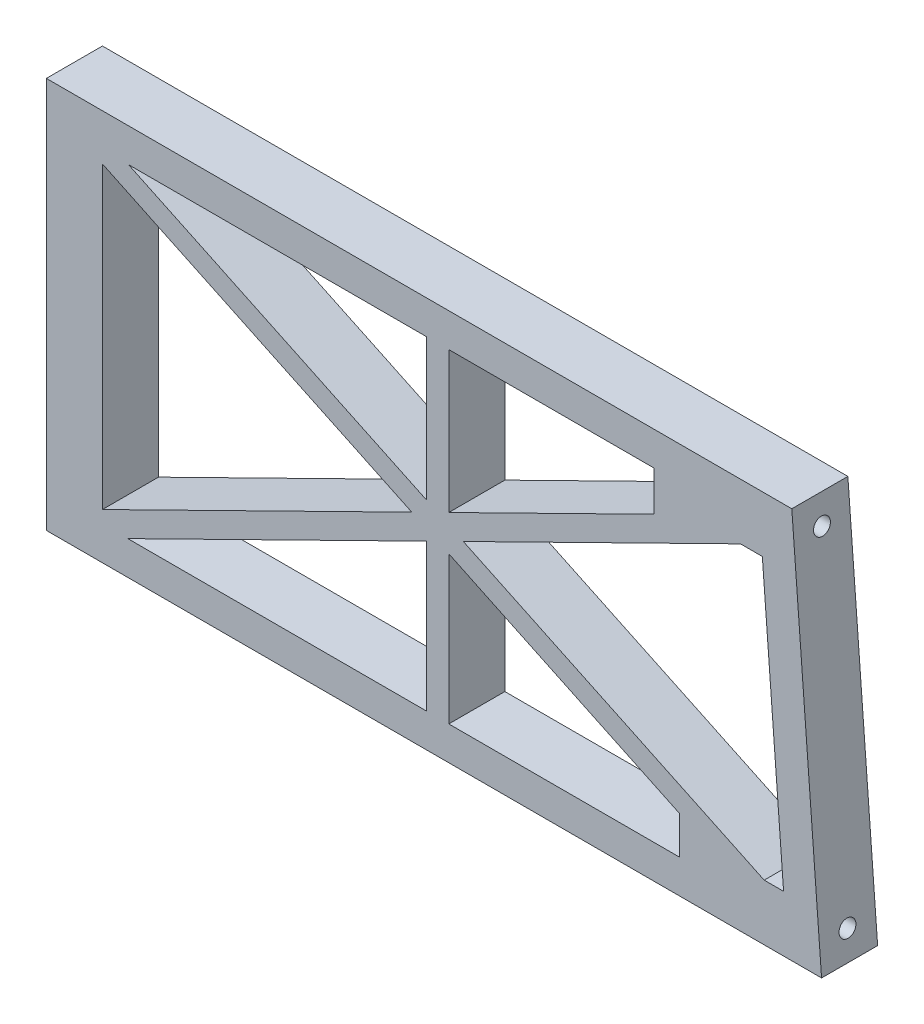
ISO-10303-21;
HEADER;
FILE_DESCRIPTION(('STEP AP214'),'2;1');
FILE_NAME('part.step','',(''),(''),'','','');
FILE_SCHEMA(('AUTOMOTIVE_DESIGN { 1 0 10303 214 1 1 1 1 }'));
ENDSEC;
DATA;
#1=APPLICATION_CONTEXT('core data for automotive mechanical design processes');
#2=APPLICATION_PROTOCOL_DEFINITION('international standard','automotive_design',2000,#1);
#3=PRODUCT_CONTEXT('',#1,'mechanical');
#4=PRODUCT('Part','Part','',(#3));
#5=PRODUCT_RELATED_PRODUCT_CATEGORY('part','',(#4));
#6=PRODUCT_DEFINITION_FORMATION('','',#4);
#7=PRODUCT_DEFINITION_CONTEXT('part definition',#1,'design');
#8=PRODUCT_DEFINITION('design','',#6,#7);
#9=PRODUCT_DEFINITION_SHAPE('','',#8);
#10=(LENGTH_UNIT() NAMED_UNIT(*) SI_UNIT(.MILLI.,.METRE.));
#11=(NAMED_UNIT(*) PLANE_ANGLE_UNIT() SI_UNIT($,.RADIAN.));
#12=(NAMED_UNIT(*) SI_UNIT($,.STERADIAN.) SOLID_ANGLE_UNIT());
#13=UNCERTAINTY_MEASURE_WITH_UNIT(LENGTH_MEASURE(1.E-05),#10,'distance_accuracy_value','');
#14=(GEOMETRIC_REPRESENTATION_CONTEXT(3) GLOBAL_UNCERTAINTY_ASSIGNED_CONTEXT((#13)) GLOBAL_UNIT_ASSIGNED_CONTEXT((#10,
#11,#12)) REPRESENTATION_CONTEXT('',''));
#15=CARTESIAN_POINT('',(0.,0.,0.));
#16=DIRECTION('',(0.,0.,1.));
#17=DIRECTION('',(1.,0.,0.));
#18=AXIS2_PLACEMENT_3D('',#15,#16,#17);
#19=CARTESIAN_POINT('',(0.,0.,0.));
#20=DIRECTION('',(1.,0.,0.));
#21=DIRECTION('',(0.,0.,-1.));
#22=AXIS2_PLACEMENT_3D('',#19,#20,#21);
#23=PLANE('',#22);
#24=DIRECTION('',(0.,-1.,0.));
#25=VECTOR('',#24,1.);
#26=CARTESIAN_POINT('',(0.,0.,-5.));
#27=LINE('',#26,#25);
#28=CARTESIAN_POINT('',(0.,34.9136152111375,-5.));
#29=VERTEX_POINT('',#28);
#30=CARTESIAN_POINT('',(0.,-34.9136152111375,-5.));
#31=VERTEX_POINT('',#30);
#32=EDGE_CURVE('E11',#29,#31,#27,.T.);
#33=ORIENTED_EDGE('',*,*,#32,.T.);
#34=DIRECTION('',(0.,0.,1.));
#35=VECTOR('',#34,1.);
#36=CARTESIAN_POINT('',(0.,-34.9136152111375,-5.));
#37=LINE('',#36,#35);
#38=CARTESIAN_POINT('',(0.,-34.9136152111375,5.));
#39=VERTEX_POINT('',#38);
#40=EDGE_CURVE('E44',#31,#39,#37,.T.);
#41=ORIENTED_EDGE('',*,*,#40,.T.);
#42=DIRECTION('',(0.,-1.,0.));
#43=VECTOR('',#42,1.);
#44=CARTESIAN_POINT('',(0.,0.,5.));
#45=LINE('',#44,#43);
#46=CARTESIAN_POINT('',(0.,34.9136152111375,5.));
#47=VERTEX_POINT('',#46);
#48=EDGE_CURVE('E379',#47,#39,#45,.T.);
#49=ORIENTED_EDGE('',*,*,#48,.F.);
#50=DIRECTION('',(0.,0.,-1.));
#51=VECTOR('',#50,1.);
#52=CARTESIAN_POINT('',(0.,34.9136152111375,-5.));
#53=LINE('',#52,#51);
#54=EDGE_CURVE('E50',#47,#29,#53,.T.);
#55=ORIENTED_EDGE('',*,*,#54,.T.);
#56=EDGE_LOOP('',(#33,#41,#49,#55));
#57=FACE_BOUND('',#56,.T.);
#58=ADVANCED_FACE('F37',(#57),#23,.F.);
#59=CARTESIAN_POINT('',(113.34,31.4136152111375,0.));
#60=DIRECTION('',(1.,0.,0.));
#61=DIRECTION('',(0.,0.,1.));
#62=AXIS2_PLACEMENT_3D('',#59,#60,#61);
#63=PLANE('',#62);
#64=CARTESIAN_POINT('',(113.34,29.9136152111375,0.));
#65=DIRECTION('',(-1.,0.,0.));
#66=DIRECTION('',(0.,0.,1.));
#67=AXIS2_PLACEMENT_3D('',#64,#65,#66);
#68=CIRCLE('',#67,1.5);
#69=CARTESIAN_POINT('',(113.34,29.9136152111375,1.5));
#70=VERTEX_POINT('',#69);
#71=EDGE_CURVE('E365',#70,#70,#68,.T.);
#72=ORIENTED_EDGE('',*,*,#71,.F.);
#73=EDGE_LOOP('',(#72));
#74=FACE_BOUND('',#73,.T.);
#75=ADVANCED_FACE('F493',(#74),#63,.T.);
#76=CARTESIAN_POINT('',(117.89,-28.4136152111376,0.));
#77=DIRECTION('',(1.,0.,0.));
#78=DIRECTION('',(0.,0.,1.));
#79=AXIS2_PLACEMENT_3D('',#76,#77,#78);
#80=PLANE('',#79);
#81=CARTESIAN_POINT('',(117.89,-29.9136152111376,0.));
#82=DIRECTION('',(-1.,0.,0.));
#83=DIRECTION('',(0.,0.,1.));
#84=AXIS2_PLACEMENT_3D('',#81,#82,#83);
#85=CIRCLE('',#84,1.5);
#86=CARTESIAN_POINT('',(117.89,-29.9136152111376,1.5));
#87=VERTEX_POINT('',#86);
#88=EDGE_CURVE('E369',#87,#87,#85,.T.);
#89=ORIENTED_EDGE('',*,*,#88,.F.);
#90=EDGE_LOOP('',(#89));
#91=FACE_BOUND('',#90,.T.);
#92=ADVANCED_FACE('F490',(#91),#80,.T.);
#93=CARTESIAN_POINT('',(152.822662449041,29.9136152111375,0.));
#94=DIRECTION('',(1.,0.,0.));
#95=DIRECTION('',(0.,0.,1.));
#96=AXIS2_PLACEMENT_3D('',#93,#94,#95);
#97=CYLINDRICAL_SURFACE('',#96,1.5);
#98=CARTESIAN_POINT('',(133.34,29.9136152111375,0.));
#99=DIRECTION('',(-0.997120507037919,-0.075833333333333,0.));
#100=DIRECTION('',(0.075833333333333,-0.997120507037919,0.));
#101=AXIS2_PLACEMENT_3D('',#98,#99,#100);
#102=ELLIPSE('',#101,1.504331712579,1.5);
#103=CARTESIAN_POINT('',(133.454078488204,28.4136152111375,0.));
#104=VERTEX_POINT('',#103);
#105=EDGE_CURVE('E224',#104,#104,#102,.F.);
#106=ORIENTED_EDGE('',*,*,#105,.T.);
#107=EDGE_LOOP('',(#106));
#108=FACE_BOUND('',#107,.T.);
#109=ORIENTED_EDGE('',*,*,#71,.T.);
#110=EDGE_LOOP('',(#109));
#111=FACE_BOUND('',#110,.T.);
#112=ADVANCED_FACE('F492',(#108,#111),#97,.F.);
#113=CARTESIAN_POINT('',(173.755810417553,-29.9136152111376,0.));
#114=DIRECTION('',(1.,0.,0.));
#115=DIRECTION('',(0.,0.,1.));
#116=AXIS2_PLACEMENT_3D('',#113,#114,#115);
#117=CYLINDRICAL_SURFACE('',#116,1.5);
#118=CARTESIAN_POINT('',(137.89,-29.9136152111376,0.));
#119=DIRECTION('',(-0.997120507037919,-0.075833333333333,0.));
#120=DIRECTION('',(0.075833333333333,-0.997120507037919,0.));
#121=AXIS2_PLACEMENT_3D('',#118,#119,#120);
#122=ELLIPSE('',#121,1.50433171257901,1.5);
#123=CARTESIAN_POINT('',(138.004078488204,-31.4136152111376,0.));
#124=VERTEX_POINT('',#123);
#125=EDGE_CURVE('E366',#124,#124,#122,.F.);
#126=ORIENTED_EDGE('',*,*,#125,.T.);
#127=EDGE_LOOP('',(#126));
#128=FACE_BOUND('',#127,.T.);
#129=ORIENTED_EDGE('',*,*,#88,.T.);
#130=EDGE_LOOP('',(#129));
#131=FACE_BOUND('',#130,.T.);
#132=ADVANCED_FACE('F488',(#128,#131),#117,.F.);
#133=CARTESIAN_POINT('',(9.99999999999999,26.6996405353847,-5.));
#134=DIRECTION('',(0.428898473159226,0.903352699515358,0.));
#135=DIRECTION('',(0.903352699515358,-0.428898473159226,0.));
#136=AXIS2_PLACEMENT_3D('',#133,#134,#135);
#137=PLANE('',#136);
#138=DIRECTION('',(0.,0.,1.));
#139=VECTOR('',#138,1.);
#140=CARTESIAN_POINT('',(9.99999999999999,26.6996405353847,-5.));
#141=LINE('',#140,#139);
#142=CARTESIAN_POINT('',(9.99999999999999,26.6996405353847,-5.));
#143=VERTEX_POINT('',#142);
#144=CARTESIAN_POINT('',(9.99999999999999,26.6996405353847,5.));
#145=VERTEX_POINT('',#144);
#146=EDGE_CURVE('E214',#143,#145,#141,.T.);
#147=ORIENTED_EDGE('',*,*,#146,.F.);
#148=DIRECTION('',(0.903352699515358,-0.428898473159226,0.));
#149=VECTOR('',#148,1.);
#150=CARTESIAN_POINT('',(9.99999999999999,26.6996405353847,-5.));
#151=LINE('',#150,#149);
#152=CARTESIAN_POINT('',(65.1852390270166,0.498506944581769,-5.));
#153=VERTEX_POINT('',#152);
#154=EDGE_CURVE('E230',#143,#153,#151,.T.);
#155=ORIENTED_EDGE('',*,*,#154,.T.);
#156=DIRECTION('',(0.,0.,1.));
#157=VECTOR('',#156,1.);
#158=CARTESIAN_POINT('',(65.1852390270166,0.498506944581769,-5.));
#159=LINE('',#158,#157);
#160=CARTESIAN_POINT('',(65.1852390270166,0.498506944581769,5.));
#161=VERTEX_POINT('',#160);
#162=EDGE_CURVE('E232',#153,#161,#159,.T.);
#163=ORIENTED_EDGE('',*,*,#162,.T.);
#164=DIRECTION('',(0.903352699515358,-0.428898473159226,0.));
#165=VECTOR('',#164,1.);
#166=CARTESIAN_POINT('',(9.99999999999999,26.6996405353847,5.));
#167=LINE('',#166,#165);
#168=EDGE_CURVE('E217',#145,#161,#167,.T.);
#169=ORIENTED_EDGE('',*,*,#168,.F.);
#170=EDGE_LOOP('',(#147,#155,#163,#169));
#171=FACE_BOUND('',#170,.T.);
#172=ADVANCED_FACE('F401',(#171),#137,.F.);
#173=CARTESIAN_POINT('',(9.99999999999999,26.6996405353847,-5.));
#174=DIRECTION('',(-1.,0.,0.));
#175=DIRECTION('',(0.,1.,0.));
#176=AXIS2_PLACEMENT_3D('',#173,#174,#175);
#177=PLANE('',#176);
#178=DIRECTION('',(0.,0.,1.));
#179=VECTOR('',#178,1.);
#180=CARTESIAN_POINT('',(10.,-26.6841521533572,-5.));
#181=LINE('',#180,#179);
#182=CARTESIAN_POINT('',(10.,-26.6841521533572,-5.));
#183=VERTEX_POINT('',#182);
#184=CARTESIAN_POINT('',(10.,-26.6841521533572,5.));
#185=VERTEX_POINT('',#184);
#186=EDGE_CURVE('E212',#183,#185,#181,.T.);
#187=ORIENTED_EDGE('',*,*,#186,.F.);
#188=DIRECTION('',(0.,1.,0.));
#189=VECTOR('',#188,1.);
#190=CARTESIAN_POINT('',(9.99999999999999,26.6996405353847,-5.));
#191=LINE('',#190,#189);
#192=EDGE_CURVE('E235',#183,#143,#191,.T.);
#193=ORIENTED_EDGE('',*,*,#192,.T.);
#194=ORIENTED_EDGE('',*,*,#146,.T.);
#195=DIRECTION('',(0.,1.,0.));
#196=VECTOR('',#195,1.);
#197=CARTESIAN_POINT('',(9.99999999999999,26.6996405353847,5.));
#198=LINE('',#197,#196);
#199=EDGE_CURVE('E207',#185,#145,#198,.T.);
#200=ORIENTED_EDGE('',*,*,#199,.F.);
#201=EDGE_LOOP('',(#187,#193,#194,#200));
#202=FACE_BOUND('',#201,.T.);
#203=ADVANCED_FACE('F209',(#202),#177,.F.);
#204=CARTESIAN_POINT('',(65.1852390270166,0.498506944581769,-5.));
#205=DIRECTION('',(0.441874282356397,-0.897076985878034,0.));
#206=DIRECTION('',(-0.897076985878034,-0.441874282356397,0.));
#207=AXIS2_PLACEMENT_3D('',#204,#205,#206);
#208=PLANE('',#207);
#209=ORIENTED_EDGE('',*,*,#162,.F.);
#210=DIRECTION('',(-0.897076985878034,-0.441874282356397,0.));
#211=VECTOR('',#210,1.);
#212=CARTESIAN_POINT('',(65.1852390270166,0.498506944581769,-5.));
#213=LINE('',#212,#211);
#214=EDGE_CURVE('E229',#153,#183,#213,.T.);
#215=ORIENTED_EDGE('',*,*,#214,.T.);
#216=ORIENTED_EDGE('',*,*,#186,.T.);
#217=DIRECTION('',(-0.897076985878034,-0.441874282356397,0.));
#218=VECTOR('',#217,1.);
#219=CARTESIAN_POINT('',(65.1852390270166,0.498506944581769,5.));
#220=LINE('',#219,#218);
#221=EDGE_CURVE('E218',#161,#185,#220,.T.);
#222=ORIENTED_EDGE('',*,*,#221,.F.);
#223=EDGE_LOOP('',(#209,#215,#216,#222));
#224=FACE_BOUND('',#223,.T.);
#225=ADVANCED_FACE('F227',(#224),#208,.F.);
#226=CARTESIAN_POINT('',(14.6631082299459,28.9136152111376,-5.));
#227=DIRECTION('',(-0.428898473159226,-0.903352699515358,0.));
#228=DIRECTION('',(-0.903352699515358,0.428898473159226,0.));
#229=AXIS2_PLACEMENT_3D('',#226,#227,#228);
#230=PLANE('',#229);
#231=DIRECTION('',(0.,0.,1.));
#232=VECTOR('',#231,1.);
#233=CARTESIAN_POINT('',(67.7786214203662,3.69515677218904,-5.));
#234=LINE('',#233,#232);
#235=CARTESIAN_POINT('',(67.7786214203662,3.69515677218904,-5.));
#236=VERTEX_POINT('',#235);
#237=CARTESIAN_POINT('',(67.7786214203662,3.69515677218905,5.));
#238=VERTEX_POINT('',#237);
#239=EDGE_CURVE('E271',#236,#238,#234,.T.);
#240=ORIENTED_EDGE('',*,*,#239,.F.);
#241=DIRECTION('',(-0.903352699515358,0.428898473159226,0.));
#242=VECTOR('',#241,1.);
#243=CARTESIAN_POINT('',(14.6631082299459,28.9136152111376,-5.));
#244=LINE('',#243,#242);
#245=CARTESIAN_POINT('',(14.6631082299459,28.9136152111376,-5.));
#246=VERTEX_POINT('',#245);
#247=EDGE_CURVE('E263',#236,#246,#244,.T.);
#248=ORIENTED_EDGE('',*,*,#247,.T.);
#249=DIRECTION('',(0.,0.,1.));
#250=VECTOR('',#249,1.);
#251=CARTESIAN_POINT('',(14.6631082299459,28.9136152111376,-5.));
#252=LINE('',#251,#250);
#253=CARTESIAN_POINT('',(14.6631082299459,28.9136152111376,5.));
#254=VERTEX_POINT('',#253);
#255=EDGE_CURVE('E267',#246,#254,#252,.T.);
#256=ORIENTED_EDGE('',*,*,#255,.T.);
#257=DIRECTION('',(-0.903352699515358,0.428898473159226,0.));
#258=VECTOR('',#257,1.);
#259=CARTESIAN_POINT('',(14.6631082299459,28.9136152111376,5.));
#260=LINE('',#259,#258);
#261=EDGE_CURVE('E468',#238,#254,#260,.T.);
#262=ORIENTED_EDGE('',*,*,#261,.F.);
#263=EDGE_LOOP('',(#240,#248,#256,#262));
#264=FACE_BOUND('',#263,.T.);
#265=ADVANCED_FACE('F561',(#264),#230,.F.);
#266=CARTESIAN_POINT('',(67.7786214203662,28.9136152111376,-5.));
#267=DIRECTION('',(1.,0.,0.));
#268=DIRECTION('',(0.,0.,1.));
#269=AXIS2_PLACEMENT_3D('',#266,#267,#268);
#270=PLANE('',#269);
#271=DIRECTION('',(0.,0.,1.));
#272=VECTOR('',#271,1.);
#273=CARTESIAN_POINT('',(67.7786214203662,28.9136152111376,-5.));
#274=LINE('',#273,#272);
#275=CARTESIAN_POINT('',(67.7786214203662,28.9136152111376,-5.));
#276=VERTEX_POINT('',#275);
#277=CARTESIAN_POINT('',(67.7786214203662,28.9136152111376,5.));
#278=VERTEX_POINT('',#277);
#279=EDGE_CURVE('E266',#276,#278,#274,.T.);
#280=ORIENTED_EDGE('',*,*,#279,.F.);
#281=DIRECTION('',(0.,-1.,0.));
#282=VECTOR('',#281,1.);
#283=CARTESIAN_POINT('',(67.7786214203662,28.9136152111376,-5.));
#284=LINE('',#283,#282);
#285=EDGE_CURVE('E260',#276,#236,#284,.T.);
#286=ORIENTED_EDGE('',*,*,#285,.T.);
#287=ORIENTED_EDGE('',*,*,#239,.T.);
#288=DIRECTION('',(0.,-1.,0.));
#289=VECTOR('',#288,1.);
#290=CARTESIAN_POINT('',(67.7786214203662,28.9136152111376,5.));
#291=LINE('',#290,#289);
#292=EDGE_CURVE('E470',#278,#238,#291,.T.);
#293=ORIENTED_EDGE('',*,*,#292,.F.);
#294=EDGE_LOOP('',(#280,#286,#287,#293));
#295=FACE_BOUND('',#294,.T.);
#296=ADVANCED_FACE('F571',(#295),#270,.F.);
#297=CARTESIAN_POINT('',(67.7786214203662,28.9136152111376,-5.));
#298=DIRECTION('',(0.,1.,0.));
#299=DIRECTION('',(1.,0.,0.));
#300=AXIS2_PLACEMENT_3D('',#297,#298,#299);
#301=PLANE('',#300);
#302=ORIENTED_EDGE('',*,*,#255,.F.);
#303=DIRECTION('',(1.,0.,0.));
#304=VECTOR('',#303,1.);
#305=CARTESIAN_POINT('',(67.7786214203662,28.9136152111376,-5.));
#306=LINE('',#305,#304);
#307=EDGE_CURVE('E252',#246,#276,#306,.T.);
#308=ORIENTED_EDGE('',*,*,#307,.T.);
#309=ORIENTED_EDGE('',*,*,#279,.T.);
#310=DIRECTION('',(1.,0.,0.));
#311=VECTOR('',#310,1.);
#312=CARTESIAN_POINT('',(67.7786214203662,28.9136152111376,5.));
#313=LINE('',#312,#311);
#314=EDGE_CURVE('E472',#254,#278,#313,.T.);
#315=ORIENTED_EDGE('',*,*,#314,.F.);
#316=EDGE_LOOP('',(#302,#308,#309,#315));
#317=FACE_BOUND('',#316,.T.);
#318=ADVANCED_FACE('F582',(#317),#301,.F.);
#319=CARTESIAN_POINT('',(127.70293477703,24.9136152111375,-5.));
#320=DIRECTION('',(0.,1.,0.));
#321=DIRECTION('',(0.,0.,1.));
#322=AXIS2_PLACEMENT_3D('',#319,#320,#321);
#323=PLANE('',#322);
#324=DIRECTION('',(0.,0.,1.));
#325=VECTOR('',#324,1.);
#326=CARTESIAN_POINT('',(123.80424621503,24.9136152111375,-5.));
#327=LINE('',#326,#325);
#328=CARTESIAN_POINT('',(123.80424621503,24.9136152111375,-5.));
#329=VERTEX_POINT('',#328);
#330=CARTESIAN_POINT('',(123.80424621503,24.9136152111375,5.));
#331=VERTEX_POINT('',#330);
#332=EDGE_CURVE('E319',#329,#331,#327,.T.);
#333=ORIENTED_EDGE('',*,*,#332,.F.);
#334=DIRECTION('',(1.,0.,0.));
#335=VECTOR('',#334,1.);
#336=CARTESIAN_POINT('',(127.70293477703,24.9136152111375,-5.));
#337=LINE('',#336,#335);
#338=CARTESIAN_POINT('',(127.70293477703,24.9136152111375,-5.));
#339=VERTEX_POINT('',#338);
#340=EDGE_CURVE('E311',#329,#339,#337,.T.);
#341=ORIENTED_EDGE('',*,*,#340,.T.);
#342=DIRECTION('',(0.,0.,1.));
#343=VECTOR('',#342,1.);
#344=CARTESIAN_POINT('',(127.70293477703,24.9136152111375,-5.));
#345=LINE('',#344,#343);
#346=CARTESIAN_POINT('',(127.70293477703,24.9136152111375,5.));
#347=VERTEX_POINT('',#346);
#348=EDGE_CURVE('E315',#339,#347,#345,.T.);
#349=ORIENTED_EDGE('',*,*,#348,.T.);
#350=DIRECTION('',(1.,0.,0.));
#351=VECTOR('',#350,1.);
#352=CARTESIAN_POINT('',(127.70293477703,24.9136152111375,5.));
#353=LINE('',#352,#351);
#354=EDGE_CURVE('E446',#331,#347,#353,.T.);
#355=ORIENTED_EDGE('',*,*,#354,.F.);
#356=EDGE_LOOP('',(#333,#341,#349,#355));
#357=FACE_BOUND('',#356,.T.);
#358=ADVANCED_FACE('F592',(#357),#323,.F.);
#359=CARTESIAN_POINT('',(123.80424621503,24.9136152111375,-5.));
#360=DIRECTION('',(-0.441874282356397,0.897076985878034,0.));
#361=DIRECTION('',(0.897076985878034,0.441874282356397,0.));
#362=AXIS2_PLACEMENT_3D('',#359,#360,#361);
#363=PLANE('',#362);
#364=DIRECTION('',(0.,0.,1.));
#365=VECTOR('',#364,1.);
#366=CARTESIAN_POINT('',(74.3720038137159,0.564716532203333,-5.));
#367=LINE('',#366,#365);
#368=CARTESIAN_POINT('',(74.3720038137159,0.564716532203333,-5.));
#369=VERTEX_POINT('',#368);
#370=CARTESIAN_POINT('',(74.3720038137159,0.564716532203333,5.));
#371=VERTEX_POINT('',#370);
#372=EDGE_CURVE('E322',#369,#371,#367,.T.);
#373=ORIENTED_EDGE('',*,*,#372,.F.);
#374=DIRECTION('',(0.897076985878034,0.441874282356397,0.));
#375=VECTOR('',#374,1.);
#376=CARTESIAN_POINT('',(123.80424621503,24.9136152111375,-5.));
#377=LINE('',#376,#375);
#378=EDGE_CURVE('E308',#369,#329,#377,.T.);
#379=ORIENTED_EDGE('',*,*,#378,.T.);
#380=ORIENTED_EDGE('',*,*,#332,.T.);
#381=DIRECTION('',(0.897076985878034,0.441874282356397,0.));
#382=VECTOR('',#381,1.);
#383=CARTESIAN_POINT('',(123.80424621503,24.9136152111375,5.));
#384=LINE('',#383,#382);
#385=EDGE_CURVE('E448',#371,#331,#384,.T.);
#386=ORIENTED_EDGE('',*,*,#385,.F.);
#387=EDGE_LOOP('',(#373,#379,#380,#386));
#388=FACE_BOUND('',#387,.T.);
#389=ADVANCED_FACE('F603',(#388),#363,.F.);
#390=CARTESIAN_POINT('',(74.3720038137159,0.564716532203333,-5.));
#391=DIRECTION('',(-0.428898473159226,-0.903352699515358,0.));
#392=DIRECTION('',(-0.903352699515358,0.428898473159226,0.));
#393=AXIS2_PLACEMENT_3D('',#390,#391,#392);
#394=PLANE('',#393);
#395=DIRECTION('',(0.,0.,1.));
#396=VECTOR('',#395,1.);
#397=CARTESIAN_POINT('',(128.034866238853,-24.9136152111376,-5.));
#398=LINE('',#397,#396);
#399=CARTESIAN_POINT('',(128.034866238853,-24.9136152111376,-5.));
#400=VERTEX_POINT('',#399);
#401=CARTESIAN_POINT('',(128.034866238853,-24.9136152111376,5.));
#402=VERTEX_POINT('',#401);
#403=EDGE_CURVE('E325',#400,#402,#398,.T.);
#404=ORIENTED_EDGE('',*,*,#403,.F.);
#405=DIRECTION('',(-0.903352699515358,0.428898473159226,0.));
#406=VECTOR('',#405,1.);
#407=CARTESIAN_POINT('',(74.3720038137159,0.564716532203333,-5.));
#408=LINE('',#407,#406);
#409=EDGE_CURVE('E305',#400,#369,#408,.T.);
#410=ORIENTED_EDGE('',*,*,#409,.T.);
#411=ORIENTED_EDGE('',*,*,#372,.T.);
#412=DIRECTION('',(-0.903352699515358,0.428898473159226,0.));
#413=VECTOR('',#412,1.);
#414=CARTESIAN_POINT('',(74.3720038137159,0.564716532203333,5.));
#415=LINE('',#414,#413);
#416=EDGE_CURVE('E452',#402,#371,#415,.T.);
#417=ORIENTED_EDGE('',*,*,#416,.F.);
#418=EDGE_LOOP('',(#404,#410,#411,#417));
#419=FACE_BOUND('',#418,.T.);
#420=ADVANCED_FACE('F614',(#419),#394,.F.);
#421=CARTESIAN_POINT('',(131.492411522338,-24.9136152111376,-5.));
#422=DIRECTION('',(0.,-1.,0.));
#423=DIRECTION('',(-1.,0.,0.));
#424=AXIS2_PLACEMENT_3D('',#421,#422,#423);
#425=PLANE('',#424);
#426=DIRECTION('',(0.,0.,1.));
#427=VECTOR('',#426,1.);
#428=CARTESIAN_POINT('',(131.492411522338,-24.9136152111376,-5.));
#429=LINE('',#428,#427);
#430=CARTESIAN_POINT('',(131.492411522338,-24.9136152111376,-5.));
#431=VERTEX_POINT('',#430);
#432=CARTESIAN_POINT('',(131.492411522338,-24.9136152111376,5.));
#433=VERTEX_POINT('',#432);
#434=EDGE_CURVE('E314',#431,#433,#429,.T.);
#435=ORIENTED_EDGE('',*,*,#434,.F.);
#436=DIRECTION('',(-1.,0.,0.));
#437=VECTOR('',#436,1.);
#438=CARTESIAN_POINT('',(131.492411522338,-24.9136152111376,-5.));
#439=LINE('',#438,#437);
#440=EDGE_CURVE('E302',#431,#400,#439,.T.);
#441=ORIENTED_EDGE('',*,*,#440,.T.);
#442=ORIENTED_EDGE('',*,*,#403,.T.);
#443=DIRECTION('',(-1.,0.,0.));
#444=VECTOR('',#443,1.);
#445=CARTESIAN_POINT('',(131.492411522338,-24.9136152111376,5.));
#446=LINE('',#445,#444);
#447=EDGE_CURVE('E454',#433,#402,#446,.T.);
#448=ORIENTED_EDGE('',*,*,#447,.F.);
#449=EDGE_LOOP('',(#435,#441,#442,#448));
#450=FACE_BOUND('',#449,.T.);
#451=ADVANCED_FACE('F625',(#450),#425,.F.);
#452=CARTESIAN_POINT('',(131.492411522338,-24.9136152111376,-5.));
#453=DIRECTION('',(0.997120507037919,0.0758333333333327,0.));
#454=DIRECTION('',(0.0758333333333327,-0.997120507037919,0.));
#455=AXIS2_PLACEMENT_3D('',#452,#453,#454);
#456=PLANE('',#455);
#457=ORIENTED_EDGE('',*,*,#348,.F.);
#458=DIRECTION('',(0.0758333333333327,-0.997120507037919,0.));
#459=VECTOR('',#458,1.);
#460=CARTESIAN_POINT('',(131.492411522338,-24.9136152111376,-5.));
#461=LINE('',#460,#459);
#462=EDGE_CURVE('E291',#339,#431,#461,.T.);
#463=ORIENTED_EDGE('',*,*,#462,.T.);
#464=ORIENTED_EDGE('',*,*,#434,.T.);
#465=DIRECTION('',(0.0758333333333327,-0.997120507037919,0.));
#466=VECTOR('',#465,1.);
#467=CARTESIAN_POINT('',(131.492411522338,-24.9136152111376,5.));
#468=LINE('',#467,#466);
#469=EDGE_CURVE('E456',#347,#433,#468,.T.);
#470=ORIENTED_EDGE('',*,*,#469,.F.);
#471=EDGE_LOOP('',(#457,#463,#464,#470));
#472=FACE_BOUND('',#471,.T.);
#473=ADVANCED_FACE('F634',(#472),#456,.F.);
#474=CARTESIAN_POINT('',(71.7786214203662,-2.63193329540394,-5.));
#475=DIRECTION('',(-1.,0.,0.));
#476=DIRECTION('',(0.,1.,0.));
#477=AXIS2_PLACEMENT_3D('',#474,#475,#476);
#478=PLANE('',#477);
#479=DIRECTION('',(0.,0.,1.));
#480=VECTOR('',#479,1.);
#481=CARTESIAN_POINT('',(71.7786214203662,-28.9136152111376,-5.));
#482=LINE('',#481,#480);
#483=CARTESIAN_POINT('',(71.7786214203662,-28.9136152111376,-5.));
#484=VERTEX_POINT('',#483);
#485=CARTESIAN_POINT('',(71.7786214203662,-28.9136152111376,5.));
#486=VERTEX_POINT('',#485);
#487=EDGE_CURVE('E346',#484,#486,#482,.T.);
#488=ORIENTED_EDGE('',*,*,#487,.F.);
#489=DIRECTION('',(0.,1.,0.));
#490=VECTOR('',#489,1.);
#491=CARTESIAN_POINT('',(71.7786214203662,-2.63193329540394,-5.));
#492=LINE('',#491,#490);
#493=CARTESIAN_POINT('',(71.7786214203662,-2.63193329540394,-5.));
#494=VERTEX_POINT('',#493);
#495=EDGE_CURVE('E338',#484,#494,#492,.T.);
#496=ORIENTED_EDGE('',*,*,#495,.T.);
#497=DIRECTION('',(0.,0.,1.));
#498=VECTOR('',#497,1.);
#499=CARTESIAN_POINT('',(71.7786214203662,-2.63193329540394,-5.));
#500=LINE('',#499,#498);
#501=CARTESIAN_POINT('',(71.7786214203662,-2.63193329540394,5.));
#502=VERTEX_POINT('',#501);
#503=EDGE_CURVE('E342',#494,#502,#500,.T.);
#504=ORIENTED_EDGE('',*,*,#503,.T.);
#505=DIRECTION('',(0.,1.,0.));
#506=VECTOR('',#505,1.);
#507=CARTESIAN_POINT('',(71.7786214203662,-2.63193329540394,5.));
#508=LINE('',#507,#506);
#509=EDGE_CURVE('E393',#486,#502,#508,.T.);
#510=ORIENTED_EDGE('',*,*,#509,.F.);
#511=EDGE_LOOP('',(#488,#496,#504,#510));
#512=FACE_BOUND('',#511,.T.);
#513=ADVANCED_FACE('F436',(#512),#478,.F.);
#514=CARTESIAN_POINT('',(71.7786214203662,-28.9136152111376,-5.));
#515=DIRECTION('',(0.,-1.,0.));
#516=DIRECTION('',(-1.,0.,0.));
#517=AXIS2_PLACEMENT_3D('',#514,#515,#516);
#518=PLANE('',#517);
#519=DIRECTION('',(0.,0.,1.));
#520=VECTOR('',#519,1.);
#521=CARTESIAN_POINT('',(112.89,-28.9136152111376,-5.));
#522=LINE('',#521,#520);
#523=CARTESIAN_POINT('',(112.89,-28.9136152111376,-5.));
#524=VERTEX_POINT('',#523);
#525=CARTESIAN_POINT('',(112.89,-28.9136152111376,5.));
#526=VERTEX_POINT('',#525);
#527=EDGE_CURVE('E349',#524,#526,#522,.T.);
#528=ORIENTED_EDGE('',*,*,#527,.F.);
#529=DIRECTION('',(-1.,0.,0.));
#530=VECTOR('',#529,1.);
#531=CARTESIAN_POINT('',(71.7786214203662,-28.9136152111376,-5.));
#532=LINE('',#531,#530);
#533=EDGE_CURVE('E335',#524,#484,#532,.T.);
#534=ORIENTED_EDGE('',*,*,#533,.T.);
#535=ORIENTED_EDGE('',*,*,#487,.T.);
#536=DIRECTION('',(-1.,0.,0.));
#537=VECTOR('',#536,1.);
#538=CARTESIAN_POINT('',(71.7786214203662,-28.9136152111376,5.));
#539=LINE('',#538,#537);
#540=EDGE_CURVE('E396',#526,#486,#539,.T.);
#541=ORIENTED_EDGE('',*,*,#540,.F.);
#542=EDGE_LOOP('',(#528,#534,#535,#541));
#543=FACE_BOUND('',#542,.T.);
#544=ADVANCED_FACE('F439',(#543),#518,.F.);
#545=CARTESIAN_POINT('',(112.89,-22.1510065341684,-5.));
#546=DIRECTION('',(1.,0.,0.));
#547=DIRECTION('',(0.,0.,1.));
#548=AXIS2_PLACEMENT_3D('',#545,#546,#547);
#549=PLANE('',#548);
#550=DIRECTION('',(0.,0.,1.));
#551=VECTOR('',#550,1.);
#552=CARTESIAN_POINT('',(112.89,-22.1510065341684,-5.));
#553=LINE('',#552,#551);
#554=CARTESIAN_POINT('',(112.89,-22.1510065341684,-5.));
#555=VERTEX_POINT('',#554);
#556=CARTESIAN_POINT('',(112.89,-22.1510065341684,5.));
#557=VERTEX_POINT('',#556);
#558=EDGE_CURVE('E341',#555,#557,#553,.T.);
#559=ORIENTED_EDGE('',*,*,#558,.F.);
#560=DIRECTION('',(0.,-1.,0.));
#561=VECTOR('',#560,1.);
#562=CARTESIAN_POINT('',(112.89,-22.1510065341684,-5.));
#563=LINE('',#562,#561);
#564=EDGE_CURVE('E332',#555,#524,#563,.T.);
#565=ORIENTED_EDGE('',*,*,#564,.T.);
#566=ORIENTED_EDGE('',*,*,#527,.T.);
#567=DIRECTION('',(0.,-1.,0.));
#568=VECTOR('',#567,1.);
#569=CARTESIAN_POINT('',(112.89,-22.1510065341684,5.));
#570=LINE('',#569,#568);
#571=EDGE_CURVE('E442',#557,#526,#570,.T.);
#572=ORIENTED_EDGE('',*,*,#571,.F.);
#573=EDGE_LOOP('',(#559,#565,#566,#572));
#574=FACE_BOUND('',#573,.T.);
#575=ADVANCED_FACE('F441',(#574),#549,.F.);
#576=CARTESIAN_POINT('',(71.7786214203662,-2.63193329540394,-5.));
#577=DIRECTION('',(0.428898473159226,0.903352699515358,0.));
#578=DIRECTION('',(0.903352699515358,-0.428898473159226,0.));
#579=AXIS2_PLACEMENT_3D('',#576,#577,#578);
#580=PLANE('',#579);
#581=ORIENTED_EDGE('',*,*,#503,.F.);
#582=DIRECTION('',(0.903352699515358,-0.428898473159226,0.));
#583=VECTOR('',#582,1.);
#584=CARTESIAN_POINT('',(71.7786214203662,-2.63193329540394,-5.));
#585=LINE('',#584,#583);
#586=EDGE_CURVE('E318',#494,#555,#585,.T.);
#587=ORIENTED_EDGE('',*,*,#586,.T.);
#588=ORIENTED_EDGE('',*,*,#558,.T.);
#589=DIRECTION('',(0.903352699515358,-0.428898473159226,0.));
#590=VECTOR('',#589,1.);
#591=CARTESIAN_POINT('',(71.7786214203662,-2.63193329540394,5.));
#592=LINE('',#591,#590);
#593=EDGE_CURVE('E433',#502,#557,#592,.T.);
#594=ORIENTED_EDGE('',*,*,#593,.F.);
#595=EDGE_LOOP('',(#581,#587,#588,#594));
#596=FACE_BOUND('',#595,.T.);
#597=ADVANCED_FACE('F430',(#596),#580,.F.);
#598=CARTESIAN_POINT('',(108.34,28.9136152111375,-5.));
#599=DIRECTION('',(0.,1.,0.));
#600=DIRECTION('',(1.,0.,0.));
#601=AXIS2_PLACEMENT_3D('',#598,#599,#600);
#602=PLANE('',#601);
#603=DIRECTION('',(0.,0.,1.));
#604=VECTOR('',#603,1.);
#605=CARTESIAN_POINT('',(71.7786214203662,28.9136152111376,-5.));
#606=LINE('',#605,#604);
#607=CARTESIAN_POINT('',(71.7786214203662,28.9136152111376,-5.));
#608=VERTEX_POINT('',#607);
#609=CARTESIAN_POINT('',(71.7786214203662,28.9136152111376,5.));
#610=VERTEX_POINT('',#609);
#611=EDGE_CURVE('E292',#608,#610,#606,.T.);
#612=ORIENTED_EDGE('',*,*,#611,.F.);
#613=DIRECTION('',(1.,0.,0.));
#614=VECTOR('',#613,1.);
#615=CARTESIAN_POINT('',(108.34,28.9136152111375,-5.));
#616=LINE('',#615,#614);
#617=CARTESIAN_POINT('',(108.34,28.9136152111375,-5.));
#618=VERTEX_POINT('',#617);
#619=EDGE_CURVE('E284',#608,#618,#616,.T.);
#620=ORIENTED_EDGE('',*,*,#619,.T.);
#621=DIRECTION('',(0.,0.,1.));
#622=VECTOR('',#621,1.);
#623=CARTESIAN_POINT('',(108.34,28.9136152111375,-5.));
#624=LINE('',#623,#622);
#625=CARTESIAN_POINT('',(108.34,28.9136152111375,5.));
#626=VERTEX_POINT('',#625);
#627=EDGE_CURVE('E288',#618,#626,#624,.T.);
#628=ORIENTED_EDGE('',*,*,#627,.T.);
#629=DIRECTION('',(1.,0.,0.));
#630=VECTOR('',#629,1.);
#631=CARTESIAN_POINT('',(108.34,28.9136152111375,5.));
#632=LINE('',#631,#630);
#633=EDGE_CURVE('E459',#610,#626,#632,.T.);
#634=ORIENTED_EDGE('',*,*,#633,.F.);
#635=EDGE_LOOP('',(#612,#620,#628,#634));
#636=FACE_BOUND('',#635,.T.);
#637=ADVANCED_FACE('F675',(#636),#602,.F.);
#638=CARTESIAN_POINT('',(71.7786214203662,28.9136152111376,-5.));
#639=DIRECTION('',(-1.,0.,0.));
#640=DIRECTION('',(0.,1.,0.));
#641=AXIS2_PLACEMENT_3D('',#638,#639,#640);
#642=PLANE('',#641);
#643=DIRECTION('',(0.,0.,1.));
#644=VECTOR('',#643,1.);
#645=CARTESIAN_POINT('',(71.7786214203662,3.74621718486966,-5.));
#646=LINE('',#645,#644);
#647=CARTESIAN_POINT('',(71.7786214203662,3.74621718486966,-5.));
#648=VERTEX_POINT('',#647);
#649=CARTESIAN_POINT('',(71.7786214203662,3.74621718486966,5.));
#650=VERTEX_POINT('',#649);
#651=EDGE_CURVE('E295',#648,#650,#646,.T.);
#652=ORIENTED_EDGE('',*,*,#651,.F.);
#653=DIRECTION('',(0.,1.,0.));
#654=VECTOR('',#653,1.);
#655=CARTESIAN_POINT('',(71.7786214203662,28.9136152111376,-5.));
#656=LINE('',#655,#654);
#657=EDGE_CURVE('E281',#648,#608,#656,.T.);
#658=ORIENTED_EDGE('',*,*,#657,.T.);
#659=ORIENTED_EDGE('',*,*,#611,.T.);
#660=DIRECTION('',(0.,1.,0.));
#661=VECTOR('',#660,1.);
#662=CARTESIAN_POINT('',(71.7786214203662,28.9136152111376,5.));
#663=LINE('',#662,#661);
#664=EDGE_CURVE('E461',#650,#610,#663,.T.);
#665=ORIENTED_EDGE('',*,*,#664,.F.);
#666=EDGE_LOOP('',(#652,#658,#659,#665));
#667=FACE_BOUND('',#666,.T.);
#668=ADVANCED_FACE('F683',(#667),#642,.F.);
#669=CARTESIAN_POINT('',(108.34,21.7552990988635,-5.));
#670=DIRECTION('',(0.441874282356397,-0.897076985878034,0.));
#671=DIRECTION('',(-0.897076985878034,-0.441874282356397,0.));
#672=AXIS2_PLACEMENT_3D('',#669,#670,#671);
#673=PLANE('',#672);
#674=DIRECTION('',(0.,0.,1.));
#675=VECTOR('',#674,1.);
#676=CARTESIAN_POINT('',(108.34,21.7552990988635,-5.));
#677=LINE('',#676,#675);
#678=CARTESIAN_POINT('',(108.34,21.7552990988635,-5.));
#679=VERTEX_POINT('',#678);
#680=CARTESIAN_POINT('',(108.34,21.7552990988635,5.));
#681=VERTEX_POINT('',#680);
#682=EDGE_CURVE('E287',#679,#681,#677,.T.);
#683=ORIENTED_EDGE('',*,*,#682,.F.);
#684=DIRECTION('',(-0.897076985878034,-0.441874282356397,0.));
#685=VECTOR('',#684,1.);
#686=CARTESIAN_POINT('',(108.34,21.7552990988635,-5.));
#687=LINE('',#686,#685);
#688=EDGE_CURVE('E278',#679,#648,#687,.T.);
#689=ORIENTED_EDGE('',*,*,#688,.T.);
#690=ORIENTED_EDGE('',*,*,#651,.T.);
#691=DIRECTION('',(-0.897076985878034,-0.441874282356397,0.));
#692=VECTOR('',#691,1.);
#693=CARTESIAN_POINT('',(108.34,21.7552990988635,5.));
#694=LINE('',#693,#692);
#695=EDGE_CURVE('E463',#681,#650,#694,.T.);
#696=ORIENTED_EDGE('',*,*,#695,.F.);
#697=EDGE_LOOP('',(#683,#689,#690,#696));
#698=FACE_BOUND('',#697,.T.);
#699=ADVANCED_FACE('F693',(#698),#673,.F.);
#700=CARTESIAN_POINT('',(108.34,21.7552990988635,-5.));
#701=DIRECTION('',(1.,0.,0.));
#702=DIRECTION('',(0.,0.,1.));
#703=AXIS2_PLACEMENT_3D('',#700,#701,#702);
#704=PLANE('',#703);
#705=ORIENTED_EDGE('',*,*,#627,.F.);
#706=DIRECTION('',(0.,-1.,0.));
#707=VECTOR('',#706,1.);
#708=CARTESIAN_POINT('',(108.34,21.7552990988635,-5.));
#709=LINE('',#708,#707);
#710=EDGE_CURVE('E270',#618,#679,#709,.T.);
#711=ORIENTED_EDGE('',*,*,#710,.T.);
#712=ORIENTED_EDGE('',*,*,#682,.T.);
#713=DIRECTION('',(0.,-1.,0.));
#714=VECTOR('',#713,1.);
#715=CARTESIAN_POINT('',(108.34,21.7552990988635,5.));
#716=LINE('',#715,#714);
#717=EDGE_CURVE('E465',#626,#681,#716,.T.);
#718=ORIENTED_EDGE('',*,*,#717,.F.);
#719=EDGE_LOOP('',(#705,#711,#712,#718));
#720=FACE_BOUND('',#719,.T.);
#721=ADVANCED_FACE('F703',(#720),#704,.F.);
#722=CARTESIAN_POINT('',(67.7786214203662,-2.68299370808455,-5.));
#723=DIRECTION('',(-0.441874282356398,0.897076985878034,0.));
#724=DIRECTION('',(0.897076985878034,0.441874282356398,0.));
#725=AXIS2_PLACEMENT_3D('',#722,#723,#724);
#726=PLANE('',#725);
#727=DIRECTION('',(0.,0.,1.));
#728=VECTOR('',#727,1.);
#729=CARTESIAN_POINT('',(14.5261742533068,-28.9136152111376,-5.));
#730=LINE('',#729,#728);
#731=CARTESIAN_POINT('',(14.5261742533068,-28.9136152111376,-5.));
#732=VERTEX_POINT('',#731);
#733=CARTESIAN_POINT('',(14.5261742533068,-28.9136152111376,5.));
#734=VERTEX_POINT('',#733);
#735=EDGE_CURVE('E253',#732,#734,#730,.T.);
#736=ORIENTED_EDGE('',*,*,#735,.F.);
#737=DIRECTION('',(0.897076985878034,0.441874282356398,0.));
#738=VECTOR('',#737,1.);
#739=CARTESIAN_POINT('',(67.7786214203662,-2.68299370808455,-5.));
#740=LINE('',#739,#738);
#741=CARTESIAN_POINT('',(67.7786214203662,-2.68299370808455,-5.));
#742=VERTEX_POINT('',#741);
#743=EDGE_CURVE('E245',#732,#742,#740,.T.);
#744=ORIENTED_EDGE('',*,*,#743,.T.);
#745=DIRECTION('',(0.,0.,1.));
#746=VECTOR('',#745,1.);
#747=CARTESIAN_POINT('',(67.7786214203662,-2.68299370808455,-5.));
#748=LINE('',#747,#746);
#749=CARTESIAN_POINT('',(67.7786214203662,-2.68299370808455,5.));
#750=VERTEX_POINT('',#749);
#751=EDGE_CURVE('E249',#742,#750,#748,.T.);
#752=ORIENTED_EDGE('',*,*,#751,.T.);
#753=DIRECTION('',(0.897076985878034,0.441874282356398,0.));
#754=VECTOR('',#753,1.);
#755=CARTESIAN_POINT('',(67.7786214203662,-2.68299370808455,5.));
#756=LINE('',#755,#754);
#757=EDGE_CURVE('E475',#734,#750,#756,.T.);
#758=ORIENTED_EDGE('',*,*,#757,.F.);
#759=EDGE_LOOP('',(#736,#744,#752,#758));
#760=FACE_BOUND('',#759,.T.);
#761=ADVANCED_FACE('F712',(#760),#726,.F.);
#762=CARTESIAN_POINT('',(14.5261742533068,-28.9136152111376,-5.));
#763=DIRECTION('',(0.,-1.,0.));
#764=DIRECTION('',(-1.,0.,0.));
#765=AXIS2_PLACEMENT_3D('',#762,#763,#764);
#766=PLANE('',#765);
#767=DIRECTION('',(0.,0.,1.));
#768=VECTOR('',#767,1.);
#769=CARTESIAN_POINT('',(67.7786214203662,-28.9136152111375,-5.));
#770=LINE('',#769,#768);
#771=CARTESIAN_POINT('',(67.7786214203662,-28.9136152111375,-5.));
#772=VERTEX_POINT('',#771);
#773=CARTESIAN_POINT('',(67.7786214203662,-28.9136152111375,5.));
#774=VERTEX_POINT('',#773);
#775=EDGE_CURVE('E248',#772,#774,#770,.T.);
#776=ORIENTED_EDGE('',*,*,#775,.F.);
#777=DIRECTION('',(-1.,0.,0.));
#778=VECTOR('',#777,1.);
#779=CARTESIAN_POINT('',(14.5261742533068,-28.9136152111376,-5.));
#780=LINE('',#779,#778);
#781=EDGE_CURVE('E242',#772,#732,#780,.T.);
#782=ORIENTED_EDGE('',*,*,#781,.T.);
#783=ORIENTED_EDGE('',*,*,#735,.T.);
#784=DIRECTION('',(-1.,0.,0.));
#785=VECTOR('',#784,1.);
#786=CARTESIAN_POINT('',(14.5261742533068,-28.9136152111376,5.));
#787=LINE('',#786,#785);
#788=EDGE_CURVE('E477',#774,#734,#787,.T.);
#789=ORIENTED_EDGE('',*,*,#788,.F.);
#790=EDGE_LOOP('',(#776,#782,#783,#789));
#791=FACE_BOUND('',#790,.T.);
#792=ADVANCED_FACE('F721',(#791),#766,.F.);
#793=CARTESIAN_POINT('',(67.7786214203662,-2.68299370808455,-5.));
#794=DIRECTION('',(1.,0.,0.));
#795=DIRECTION('',(0.,0.,1.));
#796=AXIS2_PLACEMENT_3D('',#793,#794,#795);
#797=PLANE('',#796);
#798=ORIENTED_EDGE('',*,*,#751,.F.);
#799=DIRECTION('',(0.,-1.,0.));
#800=VECTOR('',#799,1.);
#801=CARTESIAN_POINT('',(67.7786214203662,-2.68299370808455,-5.));
#802=LINE('',#801,#800);
#803=EDGE_CURVE('E239',#742,#772,#802,.T.);
#804=ORIENTED_EDGE('',*,*,#803,.T.);
#805=ORIENTED_EDGE('',*,*,#775,.T.);
#806=DIRECTION('',(0.,-1.,0.));
#807=VECTOR('',#806,1.);
#808=CARTESIAN_POINT('',(67.7786214203662,-2.68299370808455,5.));
#809=LINE('',#808,#807);
#810=EDGE_CURVE('E479',#750,#774,#809,.T.);
#811=ORIENTED_EDGE('',*,*,#810,.F.);
#812=EDGE_LOOP('',(#798,#804,#805,#811));
#813=FACE_BOUND('',#812,.T.);
#814=ADVANCED_FACE('F731',(#813),#797,.F.);
#815=CARTESIAN_POINT('',(138.270261627346,-34.9136152111376,-5.));
#816=DIRECTION('',(0.997120507037919,0.075833333333333,0.));
#817=DIRECTION('',(0.075833333333333,-0.997120507037919,0.));
#818=AXIS2_PLACEMENT_3D('',#815,#816,#817);
#819=PLANE('',#818);
#820=ORIENTED_EDGE('',*,*,#125,.F.);
#821=EDGE_LOOP('',(#820));
#822=FACE_BOUND('',#821,.T.);
#823=ORIENTED_EDGE('',*,*,#105,.F.);
#824=EDGE_LOOP('',(#823));
#825=FACE_BOUND('',#824,.T.);
#826=DIRECTION('',(0.,0.,1.));
#827=VECTOR('',#826,1.);
#828=CARTESIAN_POINT('',(138.270261627346,-34.9136152111376,-5.));
#829=LINE('',#828,#827);
#830=CARTESIAN_POINT('',(138.270261627346,-34.9136152111376,-5.));
#831=VERTEX_POINT('',#830);
#832=CARTESIAN_POINT('',(138.270261627346,-34.9136152111376,5.));
#833=VERTEX_POINT('',#832);
#834=EDGE_CURVE('E357',#831,#833,#829,.T.);
#835=ORIENTED_EDGE('',*,*,#834,.F.);
#836=DIRECTION('',(0.075833333333333,-0.997120507037919,0.));
#837=VECTOR('',#836,1.);
#838=CARTESIAN_POINT('',(138.270261627346,-34.9136152111376,-5.));
#839=LINE('',#838,#837);
#840=CARTESIAN_POINT('',(132.959738372654,34.9136152111375,-5.));
#841=VERTEX_POINT('',#840);
#842=EDGE_CURVE('E345',#841,#831,#839,.T.);
#843=ORIENTED_EDGE('',*,*,#842,.F.);
#844=DIRECTION('',(0.,0.,1.));
#845=VECTOR('',#844,1.);
#846=CARTESIAN_POINT('',(132.959738372654,34.9136152111375,-5.));
#847=LINE('',#846,#845);
#848=CARTESIAN_POINT('',(132.959738372654,34.9136152111375,5.));
#849=VERTEX_POINT('',#848);
#850=EDGE_CURVE('E356',#841,#849,#847,.T.);
#851=ORIENTED_EDGE('',*,*,#850,.T.);
#852=DIRECTION('',(0.075833333333333,-0.997120507037919,0.));
#853=VECTOR('',#852,1.);
#854=CARTESIAN_POINT('',(138.270261627346,-34.9136152111376,5.));
#855=LINE('',#854,#853);
#856=EDGE_CURVE('E388',#849,#833,#855,.T.);
#857=ORIENTED_EDGE('',*,*,#856,.T.);
#858=EDGE_LOOP('',(#835,#843,#851,#857));
#859=FACE_BOUND('',#858,.T.);
#860=ADVANCED_FACE('F390',(#822,#825,#859),#819,.T.);
#861=CARTESIAN_POINT('',(0.,-34.9136152111375,-5.));
#862=DIRECTION('',(0.,-1.,0.));
#863=DIRECTION('',(1.,0.,0.));
#864=AXIS2_PLACEMENT_3D('',#861,#862,#863);
#865=PLANE('',#864);
#866=ORIENTED_EDGE('',*,*,#40,.F.);
#867=DIRECTION('',(1.,0.,0.));
#868=VECTOR('',#867,1.);
#869=CARTESIAN_POINT('',(0.,-34.9136152111375,-5.));
#870=LINE('',#869,#868);
#871=EDGE_CURVE('E377',#31,#831,#870,.T.);
#872=ORIENTED_EDGE('',*,*,#871,.T.);
#873=ORIENTED_EDGE('',*,*,#834,.T.);
#874=DIRECTION('',(1.,0.,0.));
#875=VECTOR('',#874,1.);
#876=CARTESIAN_POINT('',(0.,-34.9136152111375,5.));
#877=LINE('',#876,#875);
#878=EDGE_CURVE('E372',#39,#833,#877,.T.);
#879=ORIENTED_EDGE('',*,*,#878,.F.);
#880=EDGE_LOOP('',(#866,#872,#873,#879));
#881=FACE_BOUND('',#880,.T.);
#882=ADVANCED_FACE('F382',(#881),#865,.T.);
#883=CARTESIAN_POINT('',(-132.959738372654,34.9136152111375,-5.));
#884=DIRECTION('',(0.,1.,0.));
#885=DIRECTION('',(-1.,0.,0.));
#886=AXIS2_PLACEMENT_3D('',#883,#884,#885);
#887=PLANE('',#886);
#888=ORIENTED_EDGE('',*,*,#54,.F.);
#889=DIRECTION('',(-1.,0.,0.));
#890=VECTOR('',#889,1.);
#891=CARTESIAN_POINT('',(-132.959738372654,34.9136152111375,5.));
#892=LINE('',#891,#890);
#893=EDGE_CURVE('E360',#849,#47,#892,.T.);
#894=ORIENTED_EDGE('',*,*,#893,.F.);
#895=ORIENTED_EDGE('',*,*,#850,.F.);
#896=DIRECTION('',(-1.,0.,0.));
#897=VECTOR('',#896,1.);
#898=CARTESIAN_POINT('',(-132.959738372654,34.9136152111375,-5.));
#899=LINE('',#898,#897);
#900=EDGE_CURVE('E374',#841,#29,#899,.T.);
#901=ORIENTED_EDGE('',*,*,#900,.T.);
#902=EDGE_LOOP('',(#888,#894,#895,#901));
#903=FACE_BOUND('',#902,.T.);
#904=ADVANCED_FACE('F756',(#903),#887,.T.);
#905=CARTESIAN_POINT('',(0.,0.,5.));
#906=DIRECTION('',(0.,0.,-1.));
#907=DIRECTION('',(-1.,0.,0.));
#908=AXIS2_PLACEMENT_3D('',#905,#906,#907);
#909=PLANE('',#908);
#910=ORIENTED_EDGE('',*,*,#893,.T.);
#911=ORIENTED_EDGE('',*,*,#48,.T.);
#912=ORIENTED_EDGE('',*,*,#878,.T.);
#913=ORIENTED_EDGE('',*,*,#856,.F.);
#914=EDGE_LOOP('',(#910,#911,#912,#913));
#915=FACE_BOUND('',#914,.T.);
#916=ORIENTED_EDGE('',*,*,#810,.T.);
#917=ORIENTED_EDGE('',*,*,#788,.T.);
#918=ORIENTED_EDGE('',*,*,#757,.T.);
#919=EDGE_LOOP('',(#916,#917,#918));
#920=FACE_BOUND('',#919,.T.);
#921=ORIENTED_EDGE('',*,*,#717,.T.);
#922=ORIENTED_EDGE('',*,*,#695,.T.);
#923=ORIENTED_EDGE('',*,*,#664,.T.);
#924=ORIENTED_EDGE('',*,*,#633,.T.);
#925=EDGE_LOOP('',(#921,#922,#923,#924));
#926=FACE_BOUND('',#925,.T.);
#927=ORIENTED_EDGE('',*,*,#593,.T.);
#928=ORIENTED_EDGE('',*,*,#571,.T.);
#929=ORIENTED_EDGE('',*,*,#540,.T.);
#930=ORIENTED_EDGE('',*,*,#509,.T.);
#931=EDGE_LOOP('',(#927,#928,#929,#930));
#932=FACE_BOUND('',#931,.T.);
#933=ORIENTED_EDGE('',*,*,#469,.T.);
#934=ORIENTED_EDGE('',*,*,#447,.T.);
#935=ORIENTED_EDGE('',*,*,#416,.T.);
#936=ORIENTED_EDGE('',*,*,#385,.T.);
#937=ORIENTED_EDGE('',*,*,#354,.T.);
#938=EDGE_LOOP('',(#933,#934,#935,#936,#937));
#939=FACE_BOUND('',#938,.T.);
#940=ORIENTED_EDGE('',*,*,#314,.T.);
#941=ORIENTED_EDGE('',*,*,#292,.T.);
#942=ORIENTED_EDGE('',*,*,#261,.T.);
#943=EDGE_LOOP('',(#940,#941,#942));
#944=FACE_BOUND('',#943,.T.);
#945=ORIENTED_EDGE('',*,*,#221,.T.);
#946=ORIENTED_EDGE('',*,*,#199,.T.);
#947=ORIENTED_EDGE('',*,*,#168,.T.);
#948=EDGE_LOOP('',(#945,#946,#947));
#949=FACE_BOUND('',#948,.T.);
#950=ADVANCED_FACE('F221',(#915,#920,#926,#932,#939,#944,#949),#909,.F.);
#951=CARTESIAN_POINT('',(0.,0.,-5.));
#952=DIRECTION('',(0.,0.,-1.));
#953=DIRECTION('',(-1.,0.,0.));
#954=AXIS2_PLACEMENT_3D('',#951,#952,#953);
#955=PLANE('',#954);
#956=ORIENTED_EDGE('',*,*,#32,.F.);
#957=ORIENTED_EDGE('',*,*,#900,.F.);
#958=ORIENTED_EDGE('',*,*,#842,.T.);
#959=ORIENTED_EDGE('',*,*,#871,.F.);
#960=EDGE_LOOP('',(#956,#957,#958,#959));
#961=FACE_BOUND('',#960,.T.);
#962=ORIENTED_EDGE('',*,*,#214,.F.);
#963=ORIENTED_EDGE('',*,*,#154,.F.);
#964=ORIENTED_EDGE('',*,*,#192,.F.);
#965=EDGE_LOOP('',(#962,#963,#964));
#966=FACE_BOUND('',#965,.T.);
#967=ORIENTED_EDGE('',*,*,#803,.F.);
#968=ORIENTED_EDGE('',*,*,#743,.F.);
#969=ORIENTED_EDGE('',*,*,#781,.F.);
#970=EDGE_LOOP('',(#967,#968,#969));
#971=FACE_BOUND('',#970,.T.);
#972=ORIENTED_EDGE('',*,*,#307,.F.);
#973=ORIENTED_EDGE('',*,*,#247,.F.);
#974=ORIENTED_EDGE('',*,*,#285,.F.);
#975=EDGE_LOOP('',(#972,#973,#974));
#976=FACE_BOUND('',#975,.T.);
#977=ORIENTED_EDGE('',*,*,#710,.F.);
#978=ORIENTED_EDGE('',*,*,#619,.F.);
#979=ORIENTED_EDGE('',*,*,#657,.F.);
#980=ORIENTED_EDGE('',*,*,#688,.F.);
#981=EDGE_LOOP('',(#977,#978,#979,#980));
#982=FACE_BOUND('',#981,.T.);
#983=ORIENTED_EDGE('',*,*,#462,.F.);
#984=ORIENTED_EDGE('',*,*,#340,.F.);
#985=ORIENTED_EDGE('',*,*,#378,.F.);
#986=ORIENTED_EDGE('',*,*,#409,.F.);
#987=ORIENTED_EDGE('',*,*,#440,.F.);
#988=EDGE_LOOP('',(#983,#984,#985,#986,#987));
#989=FACE_BOUND('',#988,.T.);
#990=ORIENTED_EDGE('',*,*,#586,.F.);
#991=ORIENTED_EDGE('',*,*,#495,.F.);
#992=ORIENTED_EDGE('',*,*,#533,.F.);
#993=ORIENTED_EDGE('',*,*,#564,.F.);
#994=EDGE_LOOP('',(#990,#991,#992,#993));
#995=FACE_BOUND('',#994,.T.);
#996=ADVANCED_FACE('F404',(#961,#966,#971,#976,#982,#989,#995),#955,.T.);
#997=CLOSED_SHELL('',(#58,#75,#92,#112,#132,#172,#203,#225,#265,#296,#318,#358,#389,#420,#451,
#473,#513,#544,#575,#597,#637,#668,#699,#721,#761,#792,#814,#860,#882,#904,#950,#996));
#998=MANIFOLD_SOLID_BREP('B2',#997);
#999=ADVANCED_BREP_SHAPE_REPRESENTATION('',(#18,#998),#14);
#1000=SHAPE_DEFINITION_REPRESENTATION(#9,#999);
ENDSEC;
END-ISO-10303-21;
